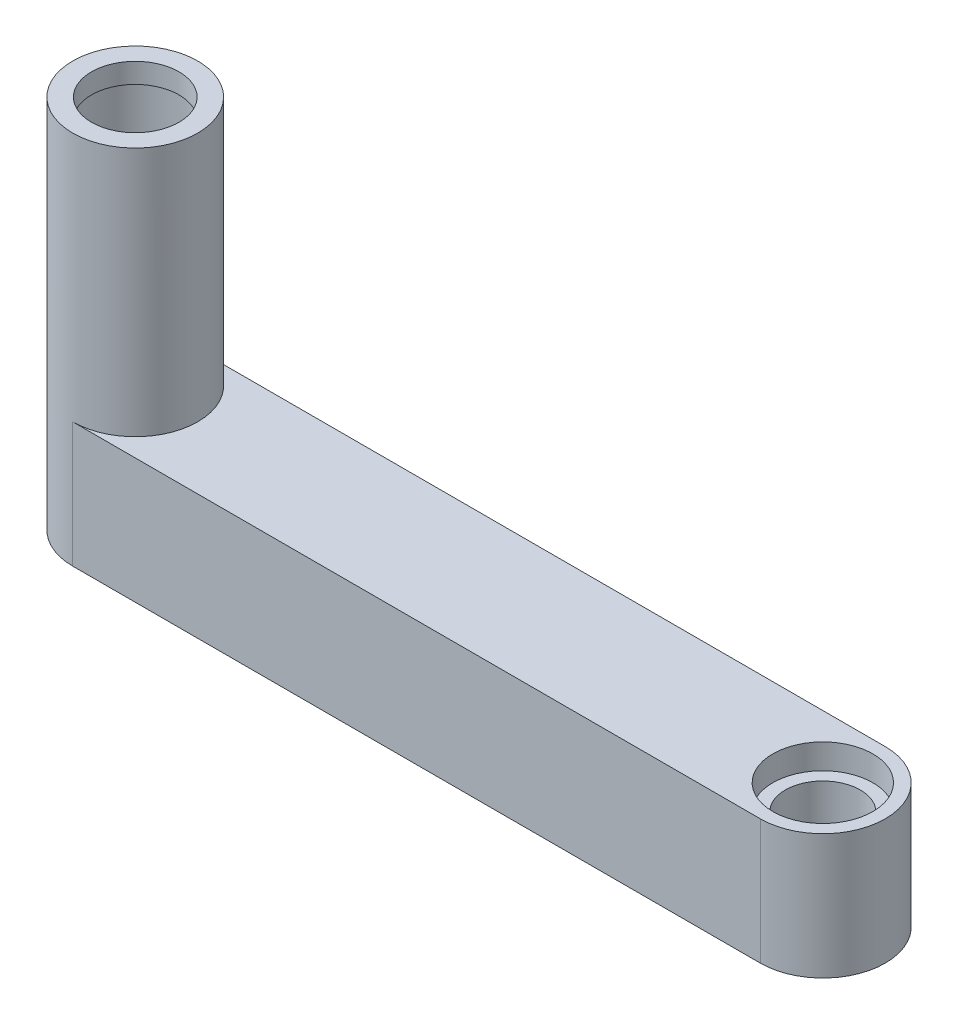
ISO-10303-21;
HEADER;
FILE_DESCRIPTION(('STEP AP214'),'2;1');
FILE_NAME('part.step','',(''),(''),'','','');
FILE_SCHEMA(('AUTOMOTIVE_DESIGN { 1 0 10303 214 1 1 1 1 }'));
ENDSEC;
DATA;
#1=APPLICATION_CONTEXT('core data for automotive mechanical design processes');
#2=APPLICATION_PROTOCOL_DEFINITION('international standard','automotive_design',2000,#1);
#3=PRODUCT_CONTEXT('',#1,'mechanical');
#4=PRODUCT('Part','Part','',(#3));
#5=PRODUCT_RELATED_PRODUCT_CATEGORY('part','',(#4));
#6=PRODUCT_DEFINITION_FORMATION('','',#4);
#7=PRODUCT_DEFINITION_CONTEXT('part definition',#1,'design');
#8=PRODUCT_DEFINITION('design','',#6,#7);
#9=PRODUCT_DEFINITION_SHAPE('','',#8);
#10=(LENGTH_UNIT() NAMED_UNIT(*) SI_UNIT(.MILLI.,.METRE.));
#11=(NAMED_UNIT(*) PLANE_ANGLE_UNIT() SI_UNIT($,.RADIAN.));
#12=(NAMED_UNIT(*) SI_UNIT($,.STERADIAN.) SOLID_ANGLE_UNIT());
#13=UNCERTAINTY_MEASURE_WITH_UNIT(LENGTH_MEASURE(1.E-05),#10,'distance_accuracy_value','');
#14=(GEOMETRIC_REPRESENTATION_CONTEXT(3) GLOBAL_UNCERTAINTY_ASSIGNED_CONTEXT((#13)) GLOBAL_UNIT_ASSIGNED_CONTEXT((#10,
#11,#12)) REPRESENTATION_CONTEXT('',''));
#15=CARTESIAN_POINT('',(0.,0.,0.));
#16=DIRECTION('',(0.,0.,1.));
#17=DIRECTION('',(1.,0.,0.));
#18=AXIS2_PLACEMENT_3D('',#15,#16,#17);
#19=CARTESIAN_POINT('',(0.,0.,0.));
#20=DIRECTION('',(0.,1.,0.));
#21=DIRECTION('',(0.,0.,1.));
#22=AXIS2_PLACEMENT_3D('',#19,#20,#21);
#23=PLANE('',#22);
#24=CARTESIAN_POINT('',(0.,0.,0.));
#25=DIRECTION('',(0.,1.,0.));
#26=DIRECTION('',(0.,0.,1.));
#27=AXIS2_PLACEMENT_3D('',#24,#25,#26);
#28=CIRCLE('',#27,24.9999999999986);
#29=CARTESIAN_POINT('',(0.,0.,24.9999999999986));
#30=VERTEX_POINT('',#29);
#31=CARTESIAN_POINT('',(3.05855537867384E-12,0.,-24.9999999999986));
#32=VERTEX_POINT('',#31);
#33=EDGE_CURVE('E368',#30,#32,#28,.F.);
#34=ORIENTED_EDGE('',*,*,#33,.T.);
#35=DIRECTION('',(1.,0.,0.));
#36=VECTOR('',#35,1.);
#37=CARTESIAN_POINT('',(0.,0.,-24.9999999999986));
#38=LINE('',#37,#36);
#39=CARTESIAN_POINT('',(275.000000000003,0.,-24.9999999999986));
#40=VERTEX_POINT('',#39);
#41=EDGE_CURVE('E377',#32,#40,#38,.T.);
#42=ORIENTED_EDGE('',*,*,#41,.T.);
#43=CARTESIAN_POINT('',(275.,0.,0.));
#44=DIRECTION('',(0.,1.,0.));
#45=DIRECTION('',(0.,0.,1.));
#46=AXIS2_PLACEMENT_3D('',#43,#44,#45);
#47=CIRCLE('',#46,24.9999999999986);
#48=CARTESIAN_POINT('',(275.000000000003,0.,24.9999999999986));
#49=VERTEX_POINT('',#48);
#50=EDGE_CURVE('E367',#49,#40,#47,.T.);
#51=ORIENTED_EDGE('',*,*,#50,.F.);
#52=DIRECTION('',(1.,0.,0.));
#53=VECTOR('',#52,1.);
#54=CARTESIAN_POINT('',(0.,0.,24.9999999999986));
#55=LINE('',#54,#53);
#56=EDGE_CURVE('E358',#30,#49,#55,.T.);
#57=ORIENTED_EDGE('',*,*,#56,.F.);
#58=EDGE_LOOP('',(#34,#42,#51,#57));
#59=FACE_BOUND('',#58,.T.);
#60=CARTESIAN_POINT('',(275.,0.,0.));
#61=DIRECTION('',(0.,1.,0.));
#62=DIRECTION('',(0.,0.,1.));
#63=AXIS2_PLACEMENT_3D('',#60,#61,#62);
#64=CIRCLE('',#63,15.);
#65=CARTESIAN_POINT('',(275.,0.,15.));
#66=VERTEX_POINT('',#65);
#67=EDGE_CURVE('E389',#66,#66,#64,.F.);
#68=ORIENTED_EDGE('',*,*,#67,.F.);
#69=EDGE_LOOP('',(#68));
#70=FACE_BOUND('',#69,.T.);
#71=CARTESIAN_POINT('',(0.,0.,0.));
#72=DIRECTION('',(0.,1.,0.));
#73=DIRECTION('',(0.,0.,1.));
#74=AXIS2_PLACEMENT_3D('',#71,#72,#73);
#75=CIRCLE('',#74,22.5);
#76=CARTESIAN_POINT('',(0.,0.,-22.5));
#77=VERTEX_POINT('',#76);
#78=CARTESIAN_POINT('',(0.,0.,22.5));
#79=VERTEX_POINT('',#78);
#80=EDGE_CURVE('E270',#77,#79,#75,.T.);
#81=ORIENTED_EDGE('',*,*,#80,.T.);
#82=DIRECTION('',(1.,0.,0.));
#83=VECTOR('',#82,1.);
#84=CARTESIAN_POINT('',(50.,0.,22.5));
#85=LINE('',#84,#83);
#86=CARTESIAN_POINT('',(50.,0.,22.5));
#87=VERTEX_POINT('',#86);
#88=EDGE_CURVE('E267',#79,#87,#85,.T.);
#89=ORIENTED_EDGE('',*,*,#88,.T.);
#90=DIRECTION('',(0.,0.,-1.));
#91=VECTOR('',#90,1.);
#92=CARTESIAN_POINT('',(50.,0.,-22.5));
#93=LINE('',#92,#91);
#94=CARTESIAN_POINT('',(50.,0.,-22.5));
#95=VERTEX_POINT('',#94);
#96=EDGE_CURVE('E264',#87,#95,#93,.T.);
#97=ORIENTED_EDGE('',*,*,#96,.T.);
#98=DIRECTION('',(-1.,0.,0.));
#99=VECTOR('',#98,1.);
#100=CARTESIAN_POINT('',(0.,0.,-22.5));
#101=LINE('',#100,#99);
#102=EDGE_CURVE('E260',#95,#77,#101,.T.);
#103=ORIENTED_EDGE('',*,*,#102,.T.);
#104=EDGE_LOOP('',(#81,#89,#97,#103));
#105=FACE_BOUND('',#104,.T.);
#106=ADVANCED_FACE('F44',(#59,#70,#105),#23,.F.);
#107=CARTESIAN_POINT('',(20.,40.,-24.9999999999986));
#108=DIRECTION('',(-1.,0.,0.));
#109=DIRECTION('',(0.,-1.,0.));
#110=AXIS2_PLACEMENT_3D('',#107,#108,#109);
#111=PLANE('',#110);
#112=DIRECTION('',(0.,-1.,0.));
#113=VECTOR('',#112,1.);
#114=CARTESIAN_POINT('',(20.,209.39696961967,-6.40312423743295));
#115=LINE('',#114,#113);
#116=CARTESIAN_POINT('',(20.,15.,-6.40312423743285));
#117=VERTEX_POINT('',#116);
#118=CARTESIAN_POINT('',(20.,40.,-6.40312423743295));
#119=VERTEX_POINT('',#118);
#120=EDGE_CURVE('E240',#117,#119,#115,.F.);
#121=ORIENTED_EDGE('',*,*,#120,.F.);
#122=DIRECTION('',(0.,0.,1.));
#123=VECTOR('',#122,1.);
#124=CARTESIAN_POINT('',(20.,15.,-24.9999999999986));
#125=LINE('',#124,#123);
#126=CARTESIAN_POINT('',(20.,15.,-10.));
#127=VERTEX_POINT('',#126);
#128=EDGE_CURVE('E273',#127,#117,#125,.T.);
#129=ORIENTED_EDGE('',*,*,#128,.F.);
#130=DIRECTION('',(0.,0.,1.));
#131=VECTOR('',#130,1.);
#132=CARTESIAN_POINT('',(20.,15.,-24.9999999999986));
#133=LINE('',#132,#131);
#134=CARTESIAN_POINT('',(20.,15.,-24.9999999999986));
#135=VERTEX_POINT('',#134);
#136=EDGE_CURVE('E422',#135,#127,#133,.T.);
#137=ORIENTED_EDGE('',*,*,#136,.F.);
#138=DIRECTION('',(0.,-1.,0.));
#139=VECTOR('',#138,1.);
#140=CARTESIAN_POINT('',(20.,40.,-24.9999999999986));
#141=LINE('',#140,#139);
#142=CARTESIAN_POINT('',(20.,40.,-24.9999999999986));
#143=VERTEX_POINT('',#142);
#144=EDGE_CURVE('E220',#143,#135,#141,.T.);
#145=ORIENTED_EDGE('',*,*,#144,.F.);
#146=DIRECTION('',(0.,0.,1.));
#147=VECTOR('',#146,1.);
#148=CARTESIAN_POINT('',(20.,40.,-24.9999999999986));
#149=LINE('',#148,#147);
#150=EDGE_CURVE('E439',#143,#119,#149,.T.);
#151=ORIENTED_EDGE('',*,*,#150,.T.);
#152=EDGE_LOOP('',(#121,#129,#137,#145,#151));
#153=FACE_BOUND('',#152,.T.);
#154=ADVANCED_FACE('F326',(#153),#111,.F.);
#155=DIRECTION('',(0.,-1.,0.));
#156=VECTOR('',#155,1.);
#157=CARTESIAN_POINT('',(20.,209.39696961967,6.40312423743295));
#158=LINE('',#157,#156);
#159=CARTESIAN_POINT('',(20.,40.,6.40312423743295));
#160=VERTEX_POINT('',#159);
#161=CARTESIAN_POINT('',(20.,15.,6.4031242374329));
#162=VERTEX_POINT('',#161);
#163=EDGE_CURVE('E242',#160,#162,#158,.T.);
#164=ORIENTED_EDGE('',*,*,#163,.F.);
#165=CARTESIAN_POINT('',(20.,40.,14.9999999999986));
#166=VERTEX_POINT('',#165);
#167=EDGE_CURVE('E438',#160,#166,#149,.T.);
#168=ORIENTED_EDGE('',*,*,#167,.T.);
#169=DIRECTION('',(0.,1.,0.));
#170=VECTOR('',#169,1.);
#171=CARTESIAN_POINT('',(20.,40.,14.9999999999986));
#172=LINE('',#171,#170);
#173=CARTESIAN_POINT('',(20.,15.,14.9999999999986));
#174=VERTEX_POINT('',#173);
#175=EDGE_CURVE('E218',#174,#166,#172,.T.);
#176=ORIENTED_EDGE('',*,*,#175,.F.);
#177=CARTESIAN_POINT('',(20.,15.,10.));
#178=VERTEX_POINT('',#177);
#179=EDGE_CURVE('E416',#178,#174,#133,.T.);
#180=ORIENTED_EDGE('',*,*,#179,.F.);
#181=EDGE_CURVE('E410',#162,#178,#133,.T.);
#182=ORIENTED_EDGE('',*,*,#181,.F.);
#183=EDGE_LOOP('',(#164,#168,#176,#180,#182));
#184=FACE_BOUND('',#183,.T.);
#185=ADVANCED_FACE('F332',(#184),#111,.F.);
#186=CARTESIAN_POINT('',(275.,150.,0.));
#187=DIRECTION('',(0.,-1.,0.));
#188=DIRECTION('',(0.,0.,-1.));
#189=AXIS2_PLACEMENT_3D('',#186,#187,#188);
#190=CYLINDRICAL_SURFACE('',#189,15.);
#191=ORIENTED_EDGE('',*,*,#67,.T.);
#192=EDGE_LOOP('',(#191));
#193=FACE_BOUND('',#192,.T.);
#194=CARTESIAN_POINT('',(275.,40.,0.));
#195=DIRECTION('',(0.,1.,0.));
#196=DIRECTION('',(0.,0.,1.));
#197=AXIS2_PLACEMENT_3D('',#194,#195,#196);
#198=CIRCLE('',#197,15.);
#199=CARTESIAN_POINT('',(275.,40.,15.));
#200=VERTEX_POINT('',#199);
#201=EDGE_CURVE('E237',#200,#200,#198,.T.);
#202=ORIENTED_EDGE('',*,*,#201,.T.);
#203=EDGE_LOOP('',(#202));
#204=FACE_BOUND('',#203,.T.);
#205=ADVANCED_FACE('F354',(#193,#204),#190,.F.);
#206=CARTESIAN_POINT('',(0.,50.,0.));
#207=DIRECTION('',(0.,-1.,0.));
#208=DIRECTION('',(0.,0.,-1.));
#209=AXIS2_PLACEMENT_3D('',#206,#207,#208);
#210=CYLINDRICAL_SURFACE('',#209,24.9999999999986);
#211=ORIENTED_EDGE('',*,*,#33,.F.);
#212=DIRECTION('',(0.,-1.,0.));
#213=VECTOR('',#212,1.);
#214=CARTESIAN_POINT('',(0.,50.,24.9999999999986));
#215=LINE('',#214,#213);
#216=CARTESIAN_POINT('',(0.,50.,24.9999999999986));
#217=VERTEX_POINT('',#216);
#218=EDGE_CURVE('E364',#217,#30,#215,.T.);
#219=ORIENTED_EDGE('',*,*,#218,.F.);
#220=CARTESIAN_POINT('',(0.,50.,0.));
#221=DIRECTION('',(0.,1.,0.));
#222=DIRECTION('',(0.,0.,1.));
#223=AXIS2_PLACEMENT_3D('',#220,#221,#222);
#224=CIRCLE('',#223,24.9999999999986);
#225=CARTESIAN_POINT('',(3.05855537867384E-12,50.,-24.9999999999986));
#226=VERTEX_POINT('',#225);
#227=EDGE_CURVE('E500',#217,#226,#224,.T.);
#228=ORIENTED_EDGE('',*,*,#227,.T.);
#229=DIRECTION('',(0.,-1.,0.));
#230=VECTOR('',#229,1.);
#231=CARTESIAN_POINT('',(3.05855537867384E-12,50.,-24.9999999999986));
#232=LINE('',#231,#230);
#233=EDGE_CURVE('E383',#226,#32,#232,.T.);
#234=ORIENTED_EDGE('',*,*,#233,.T.);
#235=EDGE_LOOP('',(#211,#219,#228,#234));
#236=FACE_BOUND('',#235,.T.);
#237=CARTESIAN_POINT('',(0.,150.,0.));
#238=DIRECTION('',(0.,1.,0.));
#239=DIRECTION('',(0.,0.,1.));
#240=AXIS2_PLACEMENT_3D('',#237,#238,#239);
#241=CIRCLE('',#240,24.9999999999986);
#242=CARTESIAN_POINT('',(0.,150.,24.9999999999986));
#243=VERTEX_POINT('',#242);
#244=EDGE_CURVE('E498',#243,#243,#241,.T.);
#245=ORIENTED_EDGE('',*,*,#244,.F.);
#246=EDGE_LOOP('',(#245));
#247=FACE_BOUND('',#246,.T.);
#248=ADVANCED_FACE('F46',(#236,#247),#210,.T.);
#249=CARTESIAN_POINT('',(0.,50.,24.9999999999986));
#250=DIRECTION('',(0.,0.,-1.));
#251=DIRECTION('',(-1.,0.,0.));
#252=AXIS2_PLACEMENT_3D('',#249,#250,#251);
#253=PLANE('',#252);
#254=ORIENTED_EDGE('',*,*,#56,.T.);
#255=DIRECTION('',(0.,-1.,0.));
#256=VECTOR('',#255,1.);
#257=CARTESIAN_POINT('',(275.000000000003,50.,24.9999999999986));
#258=LINE('',#257,#256);
#259=CARTESIAN_POINT('',(275.000000000003,50.,24.9999999999986));
#260=VERTEX_POINT('',#259);
#261=EDGE_CURVE('E361',#260,#49,#258,.T.);
#262=ORIENTED_EDGE('',*,*,#261,.F.);
#263=DIRECTION('',(1.,0.,0.));
#264=VECTOR('',#263,1.);
#265=CARTESIAN_POINT('',(0.,50.,24.9999999999986));
#266=LINE('',#265,#264);
#267=EDGE_CURVE('E379',#217,#260,#266,.T.);
#268=ORIENTED_EDGE('',*,*,#267,.F.);
#269=ORIENTED_EDGE('',*,*,#218,.T.);
#270=EDGE_LOOP('',(#254,#262,#268,#269));
#271=FACE_BOUND('',#270,.T.);
#272=ADVANCED_FACE('F347',(#271),#253,.F.);
#273=CARTESIAN_POINT('',(275.,50.,0.));
#274=DIRECTION('',(0.,-1.,0.));
#275=DIRECTION('',(0.,0.,-1.));
#276=AXIS2_PLACEMENT_3D('',#273,#274,#275);
#277=CYLINDRICAL_SURFACE('',#276,24.9999999999986);
#278=ORIENTED_EDGE('',*,*,#50,.T.);
#279=DIRECTION('',(0.,-1.,0.));
#280=VECTOR('',#279,1.);
#281=CARTESIAN_POINT('',(275.000000000003,50.,-24.9999999999986));
#282=LINE('',#281,#280);
#283=CARTESIAN_POINT('',(275.000000000003,50.,-24.9999999999986));
#284=VERTEX_POINT('',#283);
#285=EDGE_CURVE('E374',#284,#40,#282,.T.);
#286=ORIENTED_EDGE('',*,*,#285,.F.);
#287=CARTESIAN_POINT('',(275.,50.,0.));
#288=DIRECTION('',(0.,1.,0.));
#289=DIRECTION('',(0.,0.,1.));
#290=AXIS2_PLACEMENT_3D('',#287,#288,#289);
#291=CIRCLE('',#290,24.9999999999986);
#292=EDGE_CURVE('E373',#260,#284,#291,.T.);
#293=ORIENTED_EDGE('',*,*,#292,.F.);
#294=ORIENTED_EDGE('',*,*,#261,.T.);
#295=EDGE_LOOP('',(#278,#286,#293,#294));
#296=FACE_BOUND('',#295,.T.);
#297=ADVANCED_FACE('F344',(#296),#277,.T.);
#298=CARTESIAN_POINT('',(0.,50.,-24.9999999999986));
#299=DIRECTION('',(0.,0.,-1.));
#300=DIRECTION('',(-1.,0.,0.));
#301=AXIS2_PLACEMENT_3D('',#298,#299,#300);
#302=PLANE('',#301);
#303=ORIENTED_EDGE('',*,*,#144,.T.);
#304=DIRECTION('',(1.,0.,0.));
#305=VECTOR('',#304,1.);
#306=CARTESIAN_POINT('',(20.,15.,-24.9999999999986));
#307=LINE('',#306,#305);
#308=CARTESIAN_POINT('',(70.,15.,-24.9999999999986));
#309=VERTEX_POINT('',#308);
#310=EDGE_CURVE('E451',#135,#309,#307,.T.);
#311=ORIENTED_EDGE('',*,*,#310,.T.);
#312=DIRECTION('',(0.,-1.,0.));
#313=VECTOR('',#312,1.);
#314=CARTESIAN_POINT('',(70.,15.,-24.9999999999986));
#315=LINE('',#314,#313);
#316=CARTESIAN_POINT('',(70.,10.,-24.9999999999986));
#317=VERTEX_POINT('',#316);
#318=EDGE_CURVE('E448',#309,#317,#315,.T.);
#319=ORIENTED_EDGE('',*,*,#318,.T.);
#320=DIRECTION('',(1.,0.,0.));
#321=VECTOR('',#320,1.);
#322=CARTESIAN_POINT('',(70.,10.,-24.9999999999986));
#323=LINE('',#322,#321);
#324=CARTESIAN_POINT('',(250.000000000003,10.,-24.9999999999986));
#325=VERTEX_POINT('',#324);
#326=EDGE_CURVE('E445',#317,#325,#323,.T.);
#327=ORIENTED_EDGE('',*,*,#326,.T.);
#328=DIRECTION('',(0.,1.,0.));
#329=VECTOR('',#328,1.);
#330=CARTESIAN_POINT('',(250.000000000003,40.,-24.9999999999986));
#331=LINE('',#330,#329);
#332=CARTESIAN_POINT('',(250.000000000003,40.,-24.9999999999986));
#333=VERTEX_POINT('',#332);
#334=EDGE_CURVE('E424',#325,#333,#331,.T.);
#335=ORIENTED_EDGE('',*,*,#334,.T.);
#336=DIRECTION('',(-1.,0.,0.));
#337=VECTOR('',#336,1.);
#338=CARTESIAN_POINT('',(20.,40.,-24.9999999999986));
#339=LINE('',#338,#337);
#340=EDGE_CURVE('E420',#333,#143,#339,.T.);
#341=ORIENTED_EDGE('',*,*,#340,.T.);
#342=EDGE_LOOP('',(#303,#311,#319,#327,#335,#341));
#343=FACE_BOUND('',#342,.T.);
#344=ORIENTED_EDGE('',*,*,#41,.F.);
#345=ORIENTED_EDGE('',*,*,#233,.F.);
#346=DIRECTION('',(1.,0.,0.));
#347=VECTOR('',#346,1.);
#348=CARTESIAN_POINT('',(0.,50.,-24.9999999999986));
#349=LINE('',#348,#347);
#350=EDGE_CURVE('E385',#226,#284,#349,.T.);
#351=ORIENTED_EDGE('',*,*,#350,.T.);
#352=ORIENTED_EDGE('',*,*,#285,.T.);
#353=EDGE_LOOP('',(#344,#345,#351,#352));
#354=FACE_BOUND('',#353,.T.);
#355=ADVANCED_FACE('F341',(#343,#354),#302,.T.);
#356=CARTESIAN_POINT('',(0.,50.,0.));
#357=DIRECTION('',(0.,1.,0.));
#358=DIRECTION('',(0.,0.,1.));
#359=AXIS2_PLACEMENT_3D('',#356,#357,#358);
#360=PLANE('',#359);
#361=CARTESIAN_POINT('',(275.,50.,0.));
#362=DIRECTION('',(0.,1.,0.));
#363=DIRECTION('',(0.,0.,1.));
#364=AXIS2_PLACEMENT_3D('',#361,#362,#363);
#365=CIRCLE('',#364,20.);
#366=CARTESIAN_POINT('',(275.,50.,20.));
#367=VERTEX_POINT('',#366);
#368=EDGE_CURVE('E230',#367,#367,#365,.T.);
#369=ORIENTED_EDGE('',*,*,#368,.F.);
#370=EDGE_LOOP('',(#369));
#371=FACE_BOUND('',#370,.T.);
#372=ORIENTED_EDGE('',*,*,#227,.F.);
#373=ORIENTED_EDGE('',*,*,#267,.T.);
#374=ORIENTED_EDGE('',*,*,#292,.T.);
#375=ORIENTED_EDGE('',*,*,#350,.F.);
#376=EDGE_LOOP('',(#372,#373,#374,#375));
#377=FACE_BOUND('',#376,.T.);
#378=ADVANCED_FACE('F339',(#371,#377),#360,.T.);
#379=CARTESIAN_POINT('',(0.,150.,0.));
#380=DIRECTION('',(0.,1.,0.));
#381=DIRECTION('',(0.,0.,1.));
#382=AXIS2_PLACEMENT_3D('',#379,#380,#381);
#383=PLANE('',#382);
#384=CARTESIAN_POINT('',(0.,150.,0.));
#385=DIRECTION('',(0.,1.,0.));
#386=DIRECTION('',(0.,0.,1.));
#387=AXIS2_PLACEMENT_3D('',#384,#385,#386);
#388=CIRCLE('',#387,17.5);
#389=CARTESIAN_POINT('',(0.,150.,17.5));
#390=VERTEX_POINT('',#389);
#391=EDGE_CURVE('E441',#390,#390,#388,.T.);
#392=ORIENTED_EDGE('',*,*,#391,.F.);
#393=EDGE_LOOP('',(#392));
#394=FACE_BOUND('',#393,.T.);
#395=ORIENTED_EDGE('',*,*,#244,.T.);
#396=EDGE_LOOP('',(#395));
#397=FACE_BOUND('',#396,.T.);
#398=ADVANCED_FACE('F485',(#394,#397),#383,.T.);
#399=CARTESIAN_POINT('',(0.,150.001,0.));
#400=DIRECTION('',(0.,-1.,0.));
#401=DIRECTION('',(0.,0.,-1.));
#402=AXIS2_PLACEMENT_3D('',#399,#400,#401);
#403=CYLINDRICAL_SURFACE('',#402,17.5);
#404=CARTESIAN_POINT('',(0.,142.,0.));
#405=DIRECTION('',(0.,1.,0.));
#406=DIRECTION('',(0.,0.,1.));
#407=AXIS2_PLACEMENT_3D('',#404,#405,#406);
#408=CIRCLE('',#407,17.5);
#409=CARTESIAN_POINT('',(0.,142.,17.5));
#410=VERTEX_POINT('',#409);
#411=EDGE_CURVE('E234',#410,#410,#408,.T.);
#412=ORIENTED_EDGE('',*,*,#411,.F.);
#413=EDGE_LOOP('',(#412));
#414=FACE_BOUND('',#413,.T.);
#415=ORIENTED_EDGE('',*,*,#391,.T.);
#416=EDGE_LOOP('',(#415));
#417=FACE_BOUND('',#416,.T.);
#418=ADVANCED_FACE('F483',(#414,#417),#403,.F.);
#419=CARTESIAN_POINT('',(20.,40.,-24.9999999999986));
#420=DIRECTION('',(0.,1.,0.));
#421=DIRECTION('',(-1.,0.,0.));
#422=AXIS2_PLACEMENT_3D('',#419,#420,#421);
#423=PLANE('',#422);
#424=CARTESIAN_POINT('',(0.,40.,0.));
#425=DIRECTION('',(0.,1.,0.));
#426=DIRECTION('',(-1.,0.,0.));
#427=AXIS2_PLACEMENT_3D('',#424,#425,#426);
#428=CIRCLE('',#427,21.);
#429=EDGE_CURVE('E238',#119,#160,#428,.F.);
#430=ORIENTED_EDGE('',*,*,#429,.F.);
#431=ORIENTED_EDGE('',*,*,#150,.F.);
#432=ORIENTED_EDGE('',*,*,#340,.F.);
#433=DIRECTION('',(0.,0.,1.));
#434=VECTOR('',#433,1.);
#435=CARTESIAN_POINT('',(250.000000000003,40.,-24.9999999999986));
#436=LINE('',#435,#434);
#437=CARTESIAN_POINT('',(250.000000000003,40.,14.9999999999986));
#438=VERTEX_POINT('',#437);
#439=EDGE_CURVE('E436',#333,#438,#436,.T.);
#440=ORIENTED_EDGE('',*,*,#439,.T.);
#441=DIRECTION('',(1.,0.,0.));
#442=VECTOR('',#441,1.);
#443=CARTESIAN_POINT('',(20.,40.,14.9999999999986));
#444=LINE('',#443,#442);
#445=EDGE_CURVE('E229',#166,#438,#444,.T.);
#446=ORIENTED_EDGE('',*,*,#445,.F.);
#447=ORIENTED_EDGE('',*,*,#167,.F.);
#448=EDGE_LOOP('',(#430,#431,#432,#440,#446,#447));
#449=FACE_BOUND('',#448,.T.);
#450=ADVANCED_FACE('F462',(#449),#423,.F.);
#451=CARTESIAN_POINT('',(250.000000000003,40.,-24.9999999999986));
#452=DIRECTION('',(1.,0.,0.));
#453=DIRECTION('',(0.,0.,-1.));
#454=AXIS2_PLACEMENT_3D('',#451,#452,#453);
#455=PLANE('',#454);
#456=ORIENTED_EDGE('',*,*,#439,.F.);
#457=ORIENTED_EDGE('',*,*,#334,.F.);
#458=DIRECTION('',(0.,0.,1.));
#459=VECTOR('',#458,1.);
#460=CARTESIAN_POINT('',(250.000000000003,10.,-24.9999999999986));
#461=LINE('',#460,#459);
#462=CARTESIAN_POINT('',(250.000000000003,10.,14.9999999999986));
#463=VERTEX_POINT('',#462);
#464=EDGE_CURVE('E432',#325,#463,#461,.T.);
#465=ORIENTED_EDGE('',*,*,#464,.T.);
#466=DIRECTION('',(0.,-1.,0.));
#467=VECTOR('',#466,1.);
#468=CARTESIAN_POINT('',(250.000000000003,40.,14.9999999999986));
#469=LINE('',#468,#467);
#470=EDGE_CURVE('E224',#438,#463,#469,.T.);
#471=ORIENTED_EDGE('',*,*,#470,.F.);
#472=EDGE_LOOP('',(#456,#457,#465,#471));
#473=FACE_BOUND('',#472,.T.);
#474=ADVANCED_FACE('F466',(#473),#455,.F.);
#475=CARTESIAN_POINT('',(70.,10.,-24.9999999999986));
#476=DIRECTION('',(0.,-1.,0.));
#477=DIRECTION('',(1.,0.,0.));
#478=AXIS2_PLACEMENT_3D('',#475,#476,#477);
#479=PLANE('',#478);
#480=ORIENTED_EDGE('',*,*,#464,.F.);
#481=ORIENTED_EDGE('',*,*,#326,.F.);
#482=DIRECTION('',(0.,0.,1.));
#483=VECTOR('',#482,1.);
#484=CARTESIAN_POINT('',(70.,10.,-24.9999999999986));
#485=LINE('',#484,#483);
#486=CARTESIAN_POINT('',(70.,10.,14.9999999999986));
#487=VERTEX_POINT('',#486);
#488=EDGE_CURVE('E430',#317,#487,#485,.T.);
#489=ORIENTED_EDGE('',*,*,#488,.T.);
#490=DIRECTION('',(-1.,0.,0.));
#491=VECTOR('',#490,1.);
#492=CARTESIAN_POINT('',(70.,10.,14.9999999999986));
#493=LINE('',#492,#491);
#494=EDGE_CURVE('E223',#463,#487,#493,.T.);
#495=ORIENTED_EDGE('',*,*,#494,.F.);
#496=EDGE_LOOP('',(#480,#481,#489,#495));
#497=FACE_BOUND('',#496,.T.);
#498=ADVANCED_FACE('F470',(#497),#479,.F.);
#499=CARTESIAN_POINT('',(70.,15.,-24.9999999999986));
#500=DIRECTION('',(-1.,0.,0.));
#501=DIRECTION('',(0.,0.,1.));
#502=AXIS2_PLACEMENT_3D('',#499,#500,#501);
#503=PLANE('',#502);
#504=ORIENTED_EDGE('',*,*,#488,.F.);
#505=ORIENTED_EDGE('',*,*,#318,.F.);
#506=DIRECTION('',(0.,0.,1.));
#507=VECTOR('',#506,1.);
#508=CARTESIAN_POINT('',(70.,15.,-24.9999999999986));
#509=LINE('',#508,#507);
#510=CARTESIAN_POINT('',(70.,15.,14.9999999999986));
#511=VERTEX_POINT('',#510);
#512=EDGE_CURVE('E428',#309,#511,#509,.T.);
#513=ORIENTED_EDGE('',*,*,#512,.T.);
#514=DIRECTION('',(0.,1.,0.));
#515=VECTOR('',#514,1.);
#516=CARTESIAN_POINT('',(70.,15.,14.9999999999986));
#517=LINE('',#516,#515);
#518=EDGE_CURVE('E217',#487,#511,#517,.T.);
#519=ORIENTED_EDGE('',*,*,#518,.F.);
#520=EDGE_LOOP('',(#504,#505,#513,#519));
#521=FACE_BOUND('',#520,.T.);
#522=ADVANCED_FACE('F471',(#521),#503,.F.);
#523=CARTESIAN_POINT('',(20.,15.,-24.9999999999986));
#524=DIRECTION('',(0.,-1.,0.));
#525=DIRECTION('',(0.,0.,-1.));
#526=AXIS2_PLACEMENT_3D('',#523,#524,#525);
#527=PLANE('',#526);
#528=CARTESIAN_POINT('',(30.,15.,-16.2499999999986));
#529=DIRECTION('',(0.,-1.,0.));
#530=DIRECTION('',(0.,0.,-1.));
#531=AXIS2_PLACEMENT_3D('',#528,#529,#530);
#532=CIRCLE('',#531,2.49999999999999);
#533=CARTESIAN_POINT('',(30.,15.,-18.7499999999986));
#534=VERTEX_POINT('',#533);
#535=EDGE_CURVE('E296',#534,#534,#532,.T.);
#536=ORIENTED_EDGE('',*,*,#535,.T.);
#537=EDGE_LOOP('',(#536));
#538=FACE_BOUND('',#537,.T.);
#539=CARTESIAN_POINT('',(30.,15.,16.2499999999986));
#540=DIRECTION('',(0.,-1.,0.));
#541=DIRECTION('',(0.,0.,-1.));
#542=AXIS2_PLACEMENT_3D('',#539,#540,#541);
#543=CIRCLE('',#542,2.49999999999999);
#544=CARTESIAN_POINT('',(27.8349364905389,15.,14.9999999999986));
#545=VERTEX_POINT('',#544);
#546=CARTESIAN_POINT('',(32.1650635094611,15.,14.9999999999986));
#547=VERTEX_POINT('',#546);
#548=EDGE_CURVE('E203',#545,#547,#543,.T.);
#549=ORIENTED_EDGE('',*,*,#548,.T.);
#550=DIRECTION('',(-1.,0.,0.));
#551=VECTOR('',#550,1.);
#552=CARTESIAN_POINT('',(20.,15.,14.9999999999986));
#553=LINE('',#552,#551);
#554=EDGE_CURVE('E196',#511,#547,#553,.T.);
#555=ORIENTED_EDGE('',*,*,#554,.F.);
#556=ORIENTED_EDGE('',*,*,#512,.F.);
#557=ORIENTED_EDGE('',*,*,#310,.F.);
#558=ORIENTED_EDGE('',*,*,#136,.T.);
#559=DIRECTION('',(1.,0.,0.));
#560=VECTOR('',#559,1.);
#561=CARTESIAN_POINT('',(0.,15.,-10.));
#562=LINE('',#561,#560);
#563=CARTESIAN_POINT('',(50.,15.,-10.));
#564=VERTEX_POINT('',#563);
#565=EDGE_CURVE('E300',#127,#564,#562,.T.);
#566=ORIENTED_EDGE('',*,*,#565,.T.);
#567=DIRECTION('',(0.,0.,1.));
#568=VECTOR('',#567,1.);
#569=CARTESIAN_POINT('',(50.,15.,0.));
#570=LINE('',#569,#568);
#571=CARTESIAN_POINT('',(50.,15.,10.));
#572=VERTEX_POINT('',#571);
#573=EDGE_CURVE('E291',#564,#572,#570,.T.);
#574=ORIENTED_EDGE('',*,*,#573,.T.);
#575=DIRECTION('',(-1.,0.,0.));
#576=VECTOR('',#575,1.);
#577=CARTESIAN_POINT('',(0.,15.,10.));
#578=LINE('',#577,#576);
#579=EDGE_CURVE('E303',#572,#178,#578,.T.);
#580=ORIENTED_EDGE('',*,*,#579,.T.);
#581=ORIENTED_EDGE('',*,*,#179,.T.);
#582=EDGE_CURVE('E197',#545,#174,#553,.T.);
#583=ORIENTED_EDGE('',*,*,#582,.F.);
#584=EDGE_LOOP('',(#549,#555,#556,#557,#558,#566,#574,#580,#581,#583));
#585=FACE_BOUND('',#584,.T.);
#586=ADVANCED_FACE('F209',(#538,#585),#527,.F.);
#587=CARTESIAN_POINT('',(0.,50.,14.9999999999986));
#588=DIRECTION('',(0.,0.,-1.));
#589=DIRECTION('',(-1.,0.,0.));
#590=AXIS2_PLACEMENT_3D('',#587,#588,#589);
#591=PLANE('',#590);
#592=ORIENTED_EDGE('',*,*,#554,.T.);
#593=EDGE_CURVE('E192',#547,#545,#553,.T.);
#594=ORIENTED_EDGE('',*,*,#593,.T.);
#595=ORIENTED_EDGE('',*,*,#582,.T.);
#596=ORIENTED_EDGE('',*,*,#175,.T.);
#597=ORIENTED_EDGE('',*,*,#445,.T.);
#598=ORIENTED_EDGE('',*,*,#470,.T.);
#599=ORIENTED_EDGE('',*,*,#494,.T.);
#600=ORIENTED_EDGE('',*,*,#518,.T.);
#601=EDGE_LOOP('',(#592,#594,#595,#596,#597,#598,#599,#600));
#602=FACE_BOUND('',#601,.T.);
#603=ADVANCED_FACE('F214',(#602),#591,.T.);
#604=CARTESIAN_POINT('',(275.,40.,0.));
#605=DIRECTION('',(0.,1.,0.));
#606=DIRECTION('',(0.,0.,1.));
#607=AXIS2_PLACEMENT_3D('',#604,#605,#606);
#608=CYLINDRICAL_SURFACE('',#607,20.);
#609=CARTESIAN_POINT('',(275.,40.,0.));
#610=DIRECTION('',(0.,1.,0.));
#611=DIRECTION('',(0.,0.,1.));
#612=AXIS2_PLACEMENT_3D('',#609,#610,#611);
#613=CIRCLE('',#612,20.);
#614=CARTESIAN_POINT('',(275.,40.,20.));
#615=VERTEX_POINT('',#614);
#616=EDGE_CURVE('E233',#615,#615,#613,.T.);
#617=ORIENTED_EDGE('',*,*,#616,.F.);
#618=EDGE_LOOP('',(#617));
#619=FACE_BOUND('',#618,.T.);
#620=ORIENTED_EDGE('',*,*,#368,.T.);
#621=EDGE_LOOP('',(#620));
#622=FACE_BOUND('',#621,.T.);
#623=ADVANCED_FACE('F517',(#619,#622),#608,.F.);
#624=CARTESIAN_POINT('',(275.,40.,0.));
#625=DIRECTION('',(0.,1.,0.));
#626=DIRECTION('',(0.,0.,1.));
#627=AXIS2_PLACEMENT_3D('',#624,#625,#626);
#628=PLANE('',#627);
#629=ORIENTED_EDGE('',*,*,#201,.F.);
#630=EDGE_LOOP('',(#629));
#631=FACE_BOUND('',#630,.T.);
#632=ORIENTED_EDGE('',*,*,#616,.T.);
#633=EDGE_LOOP('',(#632));
#634=FACE_BOUND('',#633,.T.);
#635=ADVANCED_FACE('F519',(#631,#634),#628,.T.);
#636=CARTESIAN_POINT('',(0.,209.39696961967,0.));
#637=DIRECTION('',(0.,-1.,0.));
#638=DIRECTION('',(0.,0.,-1.));
#639=AXIS2_PLACEMENT_3D('',#636,#637,#638);
#640=CYLINDRICAL_SURFACE('',#639,21.);
#641=DIRECTION('',(0.,-1.,0.));
#642=VECTOR('',#641,1.);
#643=CARTESIAN_POINT('',(18.4661853126194,209.39696961967,-10.));
#644=LINE('',#643,#642);
#645=CARTESIAN_POINT('',(18.4661853126194,15.,-10.));
#646=VERTEX_POINT('',#645);
#647=CARTESIAN_POINT('',(18.4661853126194,10.,-10.));
#648=VERTEX_POINT('',#647);
#649=EDGE_CURVE('E66',#646,#648,#644,.T.);
#650=ORIENTED_EDGE('',*,*,#649,.F.);
#651=CARTESIAN_POINT('',(0.,15.,0.));
#652=DIRECTION('',(0.,-1.,0.));
#653=DIRECTION('',(0.,0.,-1.));
#654=AXIS2_PLACEMENT_3D('',#651,#652,#653);
#655=CIRCLE('',#654,21.);
#656=EDGE_CURVE('E13',#646,#117,#655,.T.);
#657=ORIENTED_EDGE('',*,*,#656,.T.);
#658=ORIENTED_EDGE('',*,*,#120,.T.);
#659=ORIENTED_EDGE('',*,*,#429,.T.);
#660=ORIENTED_EDGE('',*,*,#163,.T.);
#661=CARTESIAN_POINT('',(18.4661853126194,15.,10.));
#662=VERTEX_POINT('',#661);
#663=EDGE_CURVE('E48',#162,#662,#655,.T.);
#664=ORIENTED_EDGE('',*,*,#663,.T.);
#665=DIRECTION('',(0.,-1.,0.));
#666=VECTOR('',#665,1.);
#667=CARTESIAN_POINT('',(18.4661853126194,209.39696961967,10.));
#668=LINE('',#667,#666);
#669=CARTESIAN_POINT('',(18.4661853126194,10.,10.));
#670=VERTEX_POINT('',#669);
#671=EDGE_CURVE('E284',#670,#662,#668,.F.);
#672=ORIENTED_EDGE('',*,*,#671,.F.);
#673=CARTESIAN_POINT('',(0.,10.,0.));
#674=DIRECTION('',(0.,1.,0.));
#675=DIRECTION('',(0.,0.,1.));
#676=AXIS2_PLACEMENT_3D('',#673,#674,#675);
#677=CIRCLE('',#676,21.);
#678=EDGE_CURVE('E248',#648,#670,#677,.T.);
#679=ORIENTED_EDGE('',*,*,#678,.F.);
#680=EDGE_LOOP('',(#650,#657,#658,#659,#660,#664,#672,#679));
#681=FACE_BOUND('',#680,.T.);
#682=CARTESIAN_POINT('',(0.,142.,0.));
#683=DIRECTION('',(0.,1.,0.));
#684=DIRECTION('',(0.,0.,1.));
#685=AXIS2_PLACEMENT_3D('',#682,#683,#684);
#686=CIRCLE('',#685,21.);
#687=CARTESIAN_POINT('',(0.,142.,21.));
#688=VERTEX_POINT('',#687);
#689=EDGE_CURVE('E245',#688,#688,#686,.T.);
#690=ORIENTED_EDGE('',*,*,#689,.T.);
#691=EDGE_LOOP('',(#690));
#692=FACE_BOUND('',#691,.T.);
#693=ADVANCED_FACE('F403',(#681,#692),#640,.F.);
#694=CARTESIAN_POINT('',(0.,142.,0.));
#695=DIRECTION('',(0.,1.,0.));
#696=DIRECTION('',(0.,0.,1.));
#697=AXIS2_PLACEMENT_3D('',#694,#695,#696);
#698=PLANE('',#697);
#699=ORIENTED_EDGE('',*,*,#411,.T.);
#700=EDGE_LOOP('',(#699));
#701=FACE_BOUND('',#700,.T.);
#702=ORIENTED_EDGE('',*,*,#689,.F.);
#703=EDGE_LOOP('',(#702));
#704=FACE_BOUND('',#703,.T.);
#705=ADVANCED_FACE('F593',(#701,#704),#698,.F.);
#706=CARTESIAN_POINT('',(0.,10.,0.));
#707=DIRECTION('',(0.,-1.,0.));
#708=DIRECTION('',(0.,0.,-1.));
#709=AXIS2_PLACEMENT_3D('',#706,#707,#708);
#710=CYLINDRICAL_SURFACE('',#709,22.5);
#711=ORIENTED_EDGE('',*,*,#80,.F.);
#712=DIRECTION('',(0.,-1.,0.));
#713=VECTOR('',#712,1.);
#714=CARTESIAN_POINT('',(0.,10.,-22.5));
#715=LINE('',#714,#713);
#716=CARTESIAN_POINT('',(0.,10.,-22.5));
#717=VERTEX_POINT('',#716);
#718=EDGE_CURVE('E256',#717,#77,#715,.T.);
#719=ORIENTED_EDGE('',*,*,#718,.F.);
#720=CARTESIAN_POINT('',(0.,10.,0.));
#721=DIRECTION('',(0.,1.,0.));
#722=DIRECTION('',(0.,0.,1.));
#723=AXIS2_PLACEMENT_3D('',#720,#721,#722);
#724=CIRCLE('',#723,22.5);
#725=CARTESIAN_POINT('',(0.,10.,22.5));
#726=VERTEX_POINT('',#725);
#727=EDGE_CURVE('E263',#717,#726,#724,.T.);
#728=ORIENTED_EDGE('',*,*,#727,.T.);
#729=DIRECTION('',(0.,-1.,0.));
#730=VECTOR('',#729,1.);
#731=CARTESIAN_POINT('',(0.,10.,22.5));
#732=LINE('',#731,#730);
#733=EDGE_CURVE('E249',#726,#79,#732,.T.);
#734=ORIENTED_EDGE('',*,*,#733,.T.);
#735=EDGE_LOOP('',(#711,#719,#728,#734));
#736=FACE_BOUND('',#735,.T.);
#737=ADVANCED_FACE('F597',(#736),#710,.F.);
#738=CARTESIAN_POINT('',(50.,10.,22.5));
#739=DIRECTION('',(0.,0.,-1.));
#740=DIRECTION('',(-1.,0.,0.));
#741=AXIS2_PLACEMENT_3D('',#738,#739,#740);
#742=PLANE('',#741);
#743=ORIENTED_EDGE('',*,*,#88,.F.);
#744=ORIENTED_EDGE('',*,*,#733,.F.);
#745=DIRECTION('',(1.,0.,0.));
#746=VECTOR('',#745,1.);
#747=CARTESIAN_POINT('',(50.,10.,22.5));
#748=LINE('',#747,#746);
#749=CARTESIAN_POINT('',(50.,10.,22.5));
#750=VERTEX_POINT('',#749);
#751=EDGE_CURVE('E279',#726,#750,#748,.T.);
#752=ORIENTED_EDGE('',*,*,#751,.T.);
#753=DIRECTION('',(0.,-1.,0.));
#754=VECTOR('',#753,1.);
#755=CARTESIAN_POINT('',(50.,10.,22.5));
#756=LINE('',#755,#754);
#757=EDGE_CURVE('E252',#750,#87,#756,.T.);
#758=ORIENTED_EDGE('',*,*,#757,.T.);
#759=EDGE_LOOP('',(#743,#744,#752,#758));
#760=FACE_BOUND('',#759,.T.);
#761=ADVANCED_FACE('F614',(#760),#742,.T.);
#762=CARTESIAN_POINT('',(50.,10.,-22.5));
#763=DIRECTION('',(-1.,0.,0.));
#764=DIRECTION('',(0.,0.,1.));
#765=AXIS2_PLACEMENT_3D('',#762,#763,#764);
#766=PLANE('',#765);
#767=ORIENTED_EDGE('',*,*,#96,.F.);
#768=ORIENTED_EDGE('',*,*,#757,.F.);
#769=DIRECTION('',(0.,0.,-1.));
#770=VECTOR('',#769,1.);
#771=CARTESIAN_POINT('',(50.,10.,-22.5));
#772=LINE('',#771,#770);
#773=CARTESIAN_POINT('',(50.,10.,10.));
#774=VERTEX_POINT('',#773);
#775=EDGE_CURVE('E275',#750,#774,#772,.T.);
#776=ORIENTED_EDGE('',*,*,#775,.T.);
#777=DIRECTION('',(0.,-1.,0.));
#778=VECTOR('',#777,1.);
#779=CARTESIAN_POINT('',(50.,15.,10.));
#780=LINE('',#779,#778);
#781=EDGE_CURVE('E287',#572,#774,#780,.T.);
#782=ORIENTED_EDGE('',*,*,#781,.F.);
#783=ORIENTED_EDGE('',*,*,#573,.F.);
#784=DIRECTION('',(0.,-1.,0.));
#785=VECTOR('',#784,1.);
#786=CARTESIAN_POINT('',(50.,15.,-10.));
#787=LINE('',#786,#785);
#788=CARTESIAN_POINT('',(50.,10.,-10.));
#789=VERTEX_POINT('',#788);
#790=EDGE_CURVE('E288',#564,#789,#787,.T.);
#791=ORIENTED_EDGE('',*,*,#790,.T.);
#792=CARTESIAN_POINT('',(50.,10.,-22.5));
#793=VERTEX_POINT('',#792);
#794=EDGE_CURVE('E278',#789,#793,#772,.T.);
#795=ORIENTED_EDGE('',*,*,#794,.T.);
#796=DIRECTION('',(0.,-1.,0.));
#797=VECTOR('',#796,1.);
#798=CARTESIAN_POINT('',(50.,10.,-22.5));
#799=LINE('',#798,#797);
#800=EDGE_CURVE('E254',#793,#95,#799,.T.);
#801=ORIENTED_EDGE('',*,*,#800,.T.);
#802=EDGE_LOOP('',(#767,#768,#776,#782,#783,#791,#795,#801));
#803=FACE_BOUND('',#802,.T.);
#804=ADVANCED_FACE('F624',(#803),#766,.T.);
#805=CARTESIAN_POINT('',(0.,10.,-22.5));
#806=DIRECTION('',(0.,0.,1.));
#807=DIRECTION('',(1.,0.,0.));
#808=AXIS2_PLACEMENT_3D('',#805,#806,#807);
#809=PLANE('',#808);
#810=ORIENTED_EDGE('',*,*,#102,.F.);
#811=ORIENTED_EDGE('',*,*,#800,.F.);
#812=DIRECTION('',(-1.,0.,0.));
#813=VECTOR('',#812,1.);
#814=CARTESIAN_POINT('',(0.,10.,-22.5));
#815=LINE('',#814,#813);
#816=EDGE_CURVE('E259',#793,#717,#815,.T.);
#817=ORIENTED_EDGE('',*,*,#816,.T.);
#818=ORIENTED_EDGE('',*,*,#718,.T.);
#819=EDGE_LOOP('',(#810,#811,#817,#818));
#820=FACE_BOUND('',#819,.T.);
#821=ADVANCED_FACE('F632',(#820),#809,.T.);
#822=CARTESIAN_POINT('',(0.,10.,0.));
#823=DIRECTION('',(0.,1.,0.));
#824=DIRECTION('',(0.,0.,1.));
#825=AXIS2_PLACEMENT_3D('',#822,#823,#824);
#826=PLANE('',#825);
#827=CARTESIAN_POINT('',(30.,10.,-16.2499999999986));
#828=DIRECTION('',(0.,1.,0.));
#829=DIRECTION('',(0.,0.,1.));
#830=AXIS2_PLACEMENT_3D('',#827,#828,#829);
#831=CIRCLE('',#830,2.49999999999999);
#832=CARTESIAN_POINT('',(30.,10.,-13.7499999999986));
#833=VERTEX_POINT('',#832);
#834=EDGE_CURVE('E205',#833,#833,#831,.T.);
#835=ORIENTED_EDGE('',*,*,#834,.T.);
#836=EDGE_LOOP('',(#835));
#837=FACE_BOUND('',#836,.T.);
#838=CARTESIAN_POINT('',(30.,10.,16.2499999999986));
#839=DIRECTION('',(0.,1.,0.));
#840=DIRECTION('',(0.,0.,1.));
#841=AXIS2_PLACEMENT_3D('',#838,#839,#840);
#842=CIRCLE('',#841,2.49999999999999);
#843=CARTESIAN_POINT('',(30.,10.,18.7499999999986));
#844=VERTEX_POINT('',#843);
#845=EDGE_CURVE('E213',#844,#844,#842,.T.);
#846=ORIENTED_EDGE('',*,*,#845,.T.);
#847=EDGE_LOOP('',(#846));
#848=FACE_BOUND('',#847,.T.);
#849=ORIENTED_EDGE('',*,*,#678,.T.);
#850=DIRECTION('',(-1.,0.,0.));
#851=VECTOR('',#850,1.);
#852=CARTESIAN_POINT('',(0.,10.,10.));
#853=LINE('',#852,#851);
#854=EDGE_CURVE('E293',#774,#670,#853,.T.);
#855=ORIENTED_EDGE('',*,*,#854,.F.);
#856=ORIENTED_EDGE('',*,*,#775,.F.);
#857=ORIENTED_EDGE('',*,*,#751,.F.);
#858=ORIENTED_EDGE('',*,*,#727,.F.);
#859=ORIENTED_EDGE('',*,*,#816,.F.);
#860=ORIENTED_EDGE('',*,*,#794,.F.);
#861=DIRECTION('',(-1.,0.,0.));
#862=VECTOR('',#861,1.);
#863=CARTESIAN_POINT('',(0.,10.,-10.));
#864=LINE('',#863,#862);
#865=EDGE_CURVE('E388',#789,#648,#864,.T.);
#866=ORIENTED_EDGE('',*,*,#865,.T.);
#867=EDGE_LOOP('',(#849,#855,#856,#857,#858,#859,#860,#866));
#868=FACE_BOUND('',#867,.T.);
#869=ADVANCED_FACE('F313',(#837,#848,#868),#826,.F.);
#870=CARTESIAN_POINT('',(0.,15.,0.));
#871=DIRECTION('',(0.,-1.,0.));
#872=DIRECTION('',(0.,0.,-1.));
#873=AXIS2_PLACEMENT_3D('',#870,#871,#872);
#874=PLANE('',#873);
#875=ORIENTED_EDGE('',*,*,#181,.T.);
#876=EDGE_CURVE('E295',#178,#662,#578,.T.);
#877=ORIENTED_EDGE('',*,*,#876,.T.);
#878=ORIENTED_EDGE('',*,*,#663,.F.);
#879=EDGE_LOOP('',(#875,#877,#878));
#880=FACE_BOUND('',#879,.T.);
#881=ADVANCED_FACE('F409',(#880),#874,.T.);
#882=EDGE_CURVE('E299',#646,#127,#562,.T.);
#883=ORIENTED_EDGE('',*,*,#882,.T.);
#884=ORIENTED_EDGE('',*,*,#128,.T.);
#885=ORIENTED_EDGE('',*,*,#656,.F.);
#886=EDGE_LOOP('',(#883,#884,#885));
#887=FACE_BOUND('',#886,.T.);
#888=ADVANCED_FACE('F673',(#887),#874,.T.);
#889=CARTESIAN_POINT('',(0.,15.,10.));
#890=DIRECTION('',(0.,0.,1.));
#891=DIRECTION('',(1.,0.,0.));
#892=AXIS2_PLACEMENT_3D('',#889,#890,#891);
#893=PLANE('',#892);
#894=ORIENTED_EDGE('',*,*,#671,.T.);
#895=ORIENTED_EDGE('',*,*,#876,.F.);
#896=ORIENTED_EDGE('',*,*,#579,.F.);
#897=ORIENTED_EDGE('',*,*,#781,.T.);
#898=ORIENTED_EDGE('',*,*,#854,.T.);
#899=EDGE_LOOP('',(#894,#895,#896,#897,#898));
#900=FACE_BOUND('',#899,.T.);
#901=ADVANCED_FACE('F414',(#900),#893,.F.);
#902=CARTESIAN_POINT('',(0.,15.,-10.));
#903=DIRECTION('',(0.,0.,-1.));
#904=DIRECTION('',(-1.,0.,0.));
#905=AXIS2_PLACEMENT_3D('',#902,#903,#904);
#906=PLANE('',#905);
#907=ORIENTED_EDGE('',*,*,#649,.T.);
#908=ORIENTED_EDGE('',*,*,#865,.F.);
#909=ORIENTED_EDGE('',*,*,#790,.F.);
#910=ORIENTED_EDGE('',*,*,#565,.F.);
#911=ORIENTED_EDGE('',*,*,#882,.F.);
#912=EDGE_LOOP('',(#907,#908,#909,#910,#911));
#913=FACE_BOUND('',#912,.T.);
#914=ADVANCED_FACE('F690',(#913),#906,.F.);
#915=CARTESIAN_POINT('',(30.,22.0710678118655,16.2499999999986));
#916=DIRECTION('',(0.,-1.,0.));
#917=DIRECTION('',(0.,0.,-1.));
#918=AXIS2_PLACEMENT_3D('',#915,#916,#917);
#919=CYLINDRICAL_SURFACE('',#918,2.49999999999999);
#920=EDGE_CURVE('E58',#547,#545,#543,.T.);
#921=ORIENTED_EDGE('',*,*,#920,.F.);
#922=ORIENTED_EDGE('',*,*,#548,.F.);
#923=EDGE_LOOP('',(#921,#922));
#924=FACE_BOUND('',#923,.T.);
#925=ORIENTED_EDGE('',*,*,#845,.F.);
#926=EDGE_LOOP('',(#925));
#927=FACE_BOUND('',#926,.T.);
#928=ADVANCED_FACE('F201',(#924,#927),#919,.F.);
#929=CARTESIAN_POINT('',(20.,15.,-24.9999999999986));
#930=DIRECTION('',(0.,-1.,0.));
#931=DIRECTION('',(0.,0.,-1.));
#932=AXIS2_PLACEMENT_3D('',#929,#930,#931);
#933=PLANE('',#932);
#934=ORIENTED_EDGE('',*,*,#920,.T.);
#935=ORIENTED_EDGE('',*,*,#593,.F.);
#936=EDGE_LOOP('',(#934,#935));
#937=FACE_BOUND('',#936,.T.);
#938=ADVANCED_FACE('F193',(#937),#933,.T.);
#939=CARTESIAN_POINT('',(30.,22.0710678118655,-16.2499999999986));
#940=DIRECTION('',(0.,-1.,0.));
#941=DIRECTION('',(0.,0.,-1.));
#942=AXIS2_PLACEMENT_3D('',#939,#940,#941);
#943=CYLINDRICAL_SURFACE('',#942,2.49999999999999);
#944=ORIENTED_EDGE('',*,*,#535,.F.);
#945=EDGE_LOOP('',(#944));
#946=FACE_BOUND('',#945,.T.);
#947=ORIENTED_EDGE('',*,*,#834,.F.);
#948=EDGE_LOOP('',(#947));
#949=FACE_BOUND('',#948,.T.);
#950=ADVANCED_FACE('F316',(#946,#949),#943,.F.);
#951=CLOSED_SHELL('',(#106,#154,#185,#205,#248,#272,#297,#355,#378,#398,#418,#450,#474,#498,
#522,#586,#603,#623,#635,#693,#705,#737,#761,#804,#821,#869,#881,#888,#901,#914,#928,#938,#950));
#952=MANIFOLD_SOLID_BREP('B2',#951);
#953=ADVANCED_BREP_SHAPE_REPRESENTATION('',(#18,#952),#14);
#954=SHAPE_DEFINITION_REPRESENTATION(#9,#953);
ENDSEC;
END-ISO-10303-21;
